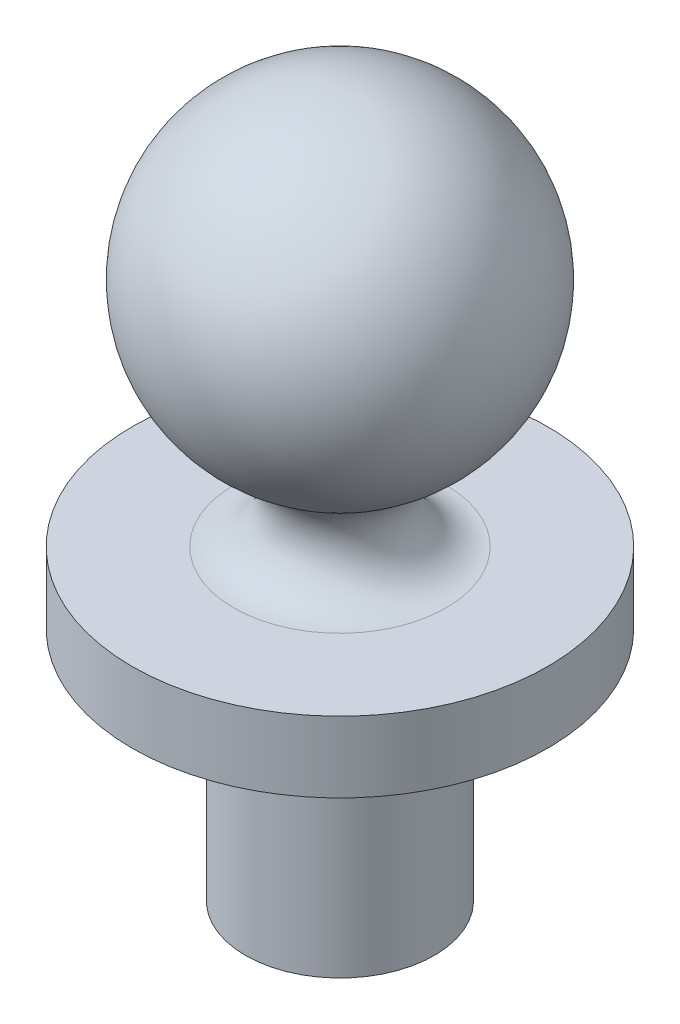
ISO-10303-21;
HEADER;
FILE_DESCRIPTION(('STEP AP214'),'2;1');
FILE_NAME('part.step','',(''),(''),'','','');
FILE_SCHEMA(('AUTOMOTIVE_DESIGN { 1 0 10303 214 1 1 1 1 }'));
ENDSEC;
DATA;
#1=APPLICATION_CONTEXT('core data for automotive mechanical design processes');
#2=APPLICATION_PROTOCOL_DEFINITION('international standard','automotive_design',2000,#1);
#3=PRODUCT_CONTEXT('',#1,'mechanical');
#4=PRODUCT('Part','Part','',(#3));
#5=PRODUCT_RELATED_PRODUCT_CATEGORY('part','',(#4));
#6=PRODUCT_DEFINITION_FORMATION('','',#4);
#7=PRODUCT_DEFINITION_CONTEXT('part definition',#1,'design');
#8=PRODUCT_DEFINITION('design','',#6,#7);
#9=PRODUCT_DEFINITION_SHAPE('','',#8);
#10=(LENGTH_UNIT() NAMED_UNIT(*) SI_UNIT(.MILLI.,.METRE.));
#11=(NAMED_UNIT(*) PLANE_ANGLE_UNIT() SI_UNIT($,.RADIAN.));
#12=(NAMED_UNIT(*) SI_UNIT($,.STERADIAN.) SOLID_ANGLE_UNIT());
#13=UNCERTAINTY_MEASURE_WITH_UNIT(LENGTH_MEASURE(1.E-05),#10,'distance_accuracy_value','');
#14=(GEOMETRIC_REPRESENTATION_CONTEXT(3) GLOBAL_UNCERTAINTY_ASSIGNED_CONTEXT((#13)) GLOBAL_UNIT_ASSIGNED_CONTEXT((#10,
#11,#12)) REPRESENTATION_CONTEXT('',''));
#15=CARTESIAN_POINT('',(0.,0.,0.));
#16=DIRECTION('',(0.,0.,1.));
#17=DIRECTION('',(1.,0.,0.));
#18=AXIS2_PLACEMENT_3D('',#15,#16,#17);
#19=CARTESIAN_POINT('',(0.,0.,0.));
#20=DIRECTION('',(0.,1.,0.));
#21=DIRECTION('',(-1.,0.,0.));
#22=AXIS2_PLACEMENT_3D('',#19,#20,#21);
#23=SPHERICAL_SURFACE('',#22,1.75);
#24=CARTESIAN_POINT('',(0.,-1.51554445662277,0.));
#25=DIRECTION('',(0.,1.,0.));
#26=DIRECTION('',(0.,0.,1.));
#27=AXIS2_PLACEMENT_3D('',#24,#25,#26);
#28=CIRCLE('',#27,0.874999999999991);
#29=CARTESIAN_POINT('',(0.,-1.51554445662277,0.874999999999991));
#30=VERTEX_POINT('',#29);
#31=EDGE_CURVE('E10',#30,#30,#28,.T.);
#32=ORIENTED_EDGE('',*,*,#31,.T.);
#33=EDGE_LOOP('',(#32));
#34=FACE_BOUND('',#33,.T.);
#35=ADVANCED_FACE('F30',(#34),#23,.T.);
#36=CARTESIAN_POINT('',(0.,-1.948557158515,0.));
#37=DIRECTION('',(0.,1.,0.));
#38=DIRECTION('',(0.,0.,1.));
#39=AXIS2_PLACEMENT_3D('',#36,#37,#38);
#40=TOROIDAL_SURFACE('',#39,1.12499999999999,0.5);
#41=CARTESIAN_POINT('',(0.,-2.448557158515,0.));
#42=DIRECTION('',(0.,1.,0.));
#43=DIRECTION('',(0.,0.,1.));
#44=AXIS2_PLACEMENT_3D('',#41,#42,#43);
#45=CIRCLE('',#44,1.12499999999999);
#46=CARTESIAN_POINT('',(0.,-2.448557158515,1.12499999999999));
#47=VERTEX_POINT('',#46);
#48=EDGE_CURVE('E36',#47,#47,#45,.T.);
#49=ORIENTED_EDGE('',*,*,#48,.T.);
#50=EDGE_LOOP('',(#49));
#51=FACE_BOUND('',#50,.T.);
#52=ORIENTED_EDGE('',*,*,#31,.F.);
#53=EDGE_LOOP('',(#52));
#54=FACE_BOUND('',#53,.T.);
#55=ADVANCED_FACE('F68',(#51,#54),#40,.F.);
#56=CARTESIAN_POINT('',(-0.355283262114401,-2.448557158515,0.));
#57=DIRECTION('',(0.,1.,0.));
#58=DIRECTION('',(0.,0.,1.));
#59=AXIS2_PLACEMENT_3D('',#56,#57,#58);
#60=PLANE('',#59);
#61=CARTESIAN_POINT('',(0.,-2.448557158515,0.));
#62=DIRECTION('',(0.,1.,0.));
#63=DIRECTION('',(0.,0.,1.));
#64=AXIS2_PLACEMENT_3D('',#61,#62,#63);
#65=CIRCLE('',#64,2.19999999999999);
#66=CARTESIAN_POINT('',(0.,-2.448557158515,2.19999999999999));
#67=VERTEX_POINT('',#66);
#68=EDGE_CURVE('E40',#67,#67,#65,.T.);
#69=ORIENTED_EDGE('',*,*,#68,.T.);
#70=EDGE_LOOP('',(#69));
#71=FACE_BOUND('',#70,.T.);
#72=ORIENTED_EDGE('',*,*,#48,.F.);
#73=EDGE_LOOP('',(#72));
#74=FACE_BOUND('',#73,.T.);
#75=ADVANCED_FACE('F72',(#71,#74),#60,.T.);
#76=CARTESIAN_POINT('',(0.,40.4201092979818,0.));
#77=DIRECTION('',(0.,1.,0.));
#78=DIRECTION('',(0.,0.,1.));
#79=AXIS2_PLACEMENT_3D('',#76,#77,#78);
#80=CYLINDRICAL_SURFACE('',#79,2.19999999999999);
#81=CARTESIAN_POINT('',(0.,-3.198557158515,0.));
#82=DIRECTION('',(0.,1.,0.));
#83=DIRECTION('',(0.,0.,1.));
#84=AXIS2_PLACEMENT_3D('',#81,#82,#83);
#85=CIRCLE('',#84,2.19999999999999);
#86=CARTESIAN_POINT('',(0.,-3.198557158515,2.19999999999999));
#87=VERTEX_POINT('',#86);
#88=EDGE_CURVE('E44',#87,#87,#85,.T.);
#89=ORIENTED_EDGE('',*,*,#88,.T.);
#90=EDGE_LOOP('',(#89));
#91=FACE_BOUND('',#90,.T.);
#92=ORIENTED_EDGE('',*,*,#68,.F.);
#93=EDGE_LOOP('',(#92));
#94=FACE_BOUND('',#93,.T.);
#95=ADVANCED_FACE('F76',(#91,#94),#80,.T.);
#96=CARTESIAN_POINT('',(-0.355283262114401,-3.198557158515,0.));
#97=DIRECTION('',(0.,-1.,0.));
#98=DIRECTION('',(0.,0.,-1.));
#99=AXIS2_PLACEMENT_3D('',#96,#97,#98);
#100=PLANE('',#99);
#101=CARTESIAN_POINT('',(0.,-3.198557158515,0.));
#102=DIRECTION('',(0.,1.,0.));
#103=DIRECTION('',(0.,0.,1.));
#104=AXIS2_PLACEMENT_3D('',#101,#102,#103);
#105=CIRCLE('',#104,0.999999999999995);
#106=CARTESIAN_POINT('',(0.,-3.198557158515,0.999999999999995));
#107=VERTEX_POINT('',#106);
#108=EDGE_CURVE('E49',#107,#107,#105,.T.);
#109=ORIENTED_EDGE('',*,*,#108,.T.);
#110=EDGE_LOOP('',(#109));
#111=FACE_BOUND('',#110,.T.);
#112=ORIENTED_EDGE('',*,*,#88,.F.);
#113=EDGE_LOOP('',(#112));
#114=FACE_BOUND('',#113,.T.);
#115=ADVANCED_FACE('F65',(#111,#114),#100,.T.);
#116=CARTESIAN_POINT('',(0.,40.4201092979818,0.));
#117=DIRECTION('',(0.,1.,0.));
#118=DIRECTION('',(0.,0.,1.));
#119=AXIS2_PLACEMENT_3D('',#116,#117,#118);
#120=CYLINDRICAL_SURFACE('',#119,0.999999999999994);
#121=CARTESIAN_POINT('',(0.,-5.69855715851499,0.));
#122=DIRECTION('',(0.,1.,0.));
#123=DIRECTION('',(0.,0.,1.));
#124=AXIS2_PLACEMENT_3D('',#121,#122,#123);
#125=CIRCLE('',#124,0.999999999999994);
#126=CARTESIAN_POINT('',(0.,-5.69855715851499,0.999999999999994));
#127=VERTEX_POINT('',#126);
#128=EDGE_CURVE('E52',#127,#127,#125,.T.);
#129=ORIENTED_EDGE('',*,*,#128,.T.);
#130=EDGE_LOOP('',(#129));
#131=FACE_BOUND('',#130,.T.);
#132=ORIENTED_EDGE('',*,*,#108,.F.);
#133=EDGE_LOOP('',(#132));
#134=FACE_BOUND('',#133,.T.);
#135=ADVANCED_FACE('F56',(#131,#134),#120,.T.);
#136=CARTESIAN_POINT('',(-0.355283262114401,-5.69855715851499,0.));
#137=DIRECTION('',(0.,-1.,0.));
#138=DIRECTION('',(0.,0.,-1.));
#139=AXIS2_PLACEMENT_3D('',#136,#137,#138);
#140=PLANE('',#139);
#141=ORIENTED_EDGE('',*,*,#128,.F.);
#142=EDGE_LOOP('',(#141));
#143=FACE_BOUND('',#142,.T.);
#144=ADVANCED_FACE('F59',(#143),#140,.T.);
#145=CLOSED_SHELL('',(#35,#55,#75,#95,#115,#135,#144));
#146=MANIFOLD_SOLID_BREP('B2',#145);
#147=ADVANCED_BREP_SHAPE_REPRESENTATION('',(#18,#146),#14);
#148=SHAPE_DEFINITION_REPRESENTATION(#9,#147);
ENDSEC;
END-ISO-10303-21;
